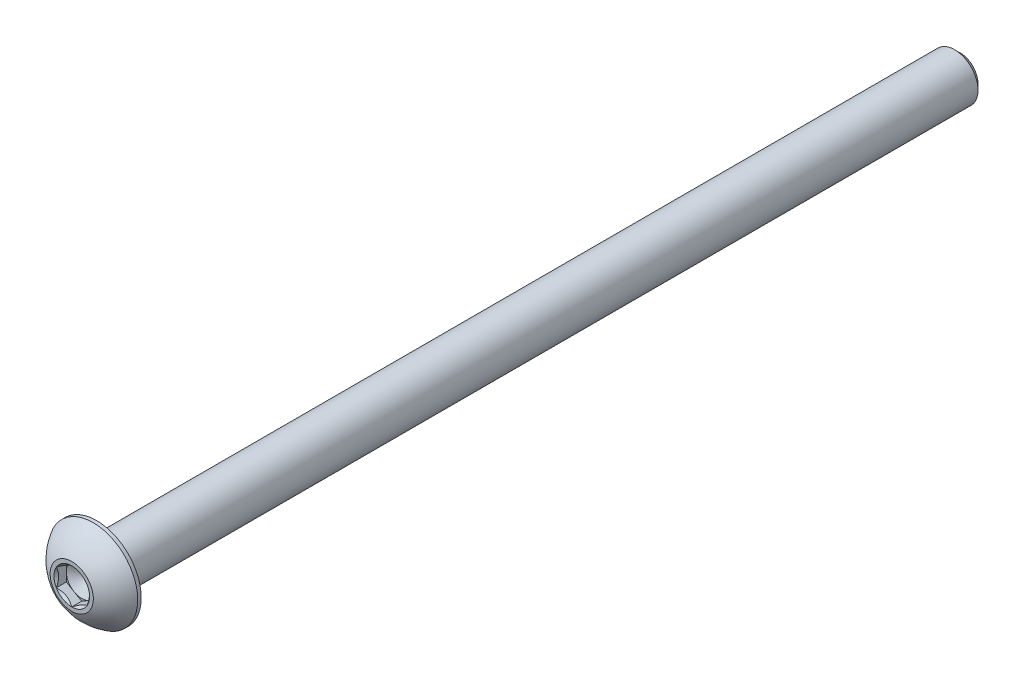
ISO-10303-21;
HEADER;
FILE_DESCRIPTION(('STEP AP214'),'2;1');
FILE_NAME('part.step','',(''),(''),'','','');
FILE_SCHEMA(('AUTOMOTIVE_DESIGN { 1 0 10303 214 1 1 1 1 }'));
ENDSEC;
DATA;
#1=APPLICATION_CONTEXT('core data for automotive mechanical design processes');
#2=APPLICATION_PROTOCOL_DEFINITION('international standard','automotive_design',2000,#1);
#3=PRODUCT_CONTEXT('',#1,'mechanical');
#4=PRODUCT('Part','Part','',(#3));
#5=PRODUCT_RELATED_PRODUCT_CATEGORY('part','',(#4));
#6=PRODUCT_DEFINITION_FORMATION('','',#4);
#7=PRODUCT_DEFINITION_CONTEXT('part definition',#1,'design');
#8=PRODUCT_DEFINITION('design','',#6,#7);
#9=PRODUCT_DEFINITION_SHAPE('','',#8);
#10=(LENGTH_UNIT() NAMED_UNIT(*) SI_UNIT(.MILLI.,.METRE.));
#11=(NAMED_UNIT(*) PLANE_ANGLE_UNIT() SI_UNIT($,.RADIAN.));
#12=(NAMED_UNIT(*) SI_UNIT($,.STERADIAN.) SOLID_ANGLE_UNIT());
#13=UNCERTAINTY_MEASURE_WITH_UNIT(LENGTH_MEASURE(1.E-05),#10,'distance_accuracy_value','');
#14=(GEOMETRIC_REPRESENTATION_CONTEXT(3) GLOBAL_UNCERTAINTY_ASSIGNED_CONTEXT((#13)) GLOBAL_UNIT_ASSIGNED_CONTEXT((#10,
#11,#12)) REPRESENTATION_CONTEXT('',''));
#15=CARTESIAN_POINT('',(0.,0.,0.));
#16=DIRECTION('',(0.,0.,1.));
#17=DIRECTION('',(1.,0.,0.));
#18=AXIS2_PLACEMENT_3D('',#15,#16,#17);
#19=CARTESIAN_POINT('',(0.,1.5875,45.7327));
#20=DIRECTION('',(0.,0.,-1.));
#21=DIRECTION('',(-1.,0.,0.));
#22=AXIS2_PLACEMENT_3D('',#19,#20,#21);
#23=PLANE('',#22);
#24=CARTESIAN_POINT('',(0.,0.,45.7327));
#25=DIRECTION('',(0.,0.,1.));
#26=DIRECTION('',(1.,0.,0.));
#27=AXIS2_PLACEMENT_3D('',#24,#25,#26);
#28=CIRCLE('',#27,2.2225);
#29=CARTESIAN_POINT('',(0.,2.22250000000001,45.7327));
#30=VERTEX_POINT('',#29);
#31=EDGE_CURVE('E191',#30,#30,#28,.T.);
#32=ORIENTED_EDGE('',*,*,#31,.T.);
#33=EDGE_LOOP('',(#32));
#34=FACE_BOUND('',#33,.T.);
#35=CARTESIAN_POINT('',(0.,0.,45.7327));
#36=DIRECTION('',(0.,0.,1.));
#37=DIRECTION('',(1.,0.,0.));
#38=AXIS2_PLACEMENT_3D('',#35,#36,#37);
#39=CIRCLE('',#38,1.83308710467706);
#40=CARTESIAN_POINT('',(0.,1.83308710467706,45.7327));
#41=VERTEX_POINT('',#40);
#42=CARTESIAN_POINT('',(-1.5875,0.91654355233853,45.7327));
#43=VERTEX_POINT('',#42);
#44=EDGE_CURVE('E133',#41,#43,#39,.T.);
#45=ORIENTED_EDGE('',*,*,#44,.F.);
#46=CARTESIAN_POINT('',(0.,0.,45.7327));
#47=DIRECTION('',(0.,0.,1.));
#48=DIRECTION('',(1.,0.,0.));
#49=AXIS2_PLACEMENT_3D('',#46,#47,#48);
#50=CIRCLE('',#49,1.83308710467706);
#51=CARTESIAN_POINT('',(1.5875,0.916543552338531,45.7327));
#52=VERTEX_POINT('',#51);
#53=EDGE_CURVE('E117',#52,#41,#50,.T.);
#54=ORIENTED_EDGE('',*,*,#53,.F.);
#55=CARTESIAN_POINT('',(0.,0.,45.7327));
#56=DIRECTION('',(0.,0.,1.));
#57=DIRECTION('',(1.,0.,0.));
#58=AXIS2_PLACEMENT_3D('',#55,#56,#57);
#59=CIRCLE('',#58,1.83308710467706);
#60=CARTESIAN_POINT('',(1.5875,-0.91654355233853,45.7327));
#61=VERTEX_POINT('',#60);
#62=EDGE_CURVE('E129',#61,#52,#59,.T.);
#63=ORIENTED_EDGE('',*,*,#62,.F.);
#64=CARTESIAN_POINT('',(0.,0.,45.7327));
#65=DIRECTION('',(0.,0.,1.));
#66=DIRECTION('',(1.,0.,0.));
#67=AXIS2_PLACEMENT_3D('',#64,#65,#66);
#68=CIRCLE('',#67,1.83308710467706);
#69=CARTESIAN_POINT('',(0.,-1.83308710467706,45.7327));
#70=VERTEX_POINT('',#69);
#71=EDGE_CURVE('E153',#70,#61,#68,.T.);
#72=ORIENTED_EDGE('',*,*,#71,.F.);
#73=CARTESIAN_POINT('',(0.,0.,45.7327));
#74=DIRECTION('',(0.,0.,1.));
#75=DIRECTION('',(1.,0.,0.));
#76=AXIS2_PLACEMENT_3D('',#73,#74,#75);
#77=CIRCLE('',#76,1.83308710467706);
#78=CARTESIAN_POINT('',(-1.5875,-0.916543552338531,45.7327));
#79=VERTEX_POINT('',#78);
#80=EDGE_CURVE('E467',#79,#70,#77,.T.);
#81=ORIENTED_EDGE('',*,*,#80,.F.);
#82=CARTESIAN_POINT('',(0.,0.,45.7327));
#83=DIRECTION('',(0.,0.,1.));
#84=DIRECTION('',(1.,0.,0.));
#85=AXIS2_PLACEMENT_3D('',#82,#83,#84);
#86=CIRCLE('',#85,1.83308710467706);
#87=EDGE_CURVE('E478',#43,#79,#86,.T.);
#88=ORIENTED_EDGE('',*,*,#87,.F.);
#89=EDGE_LOOP('',(#45,#54,#63,#72,#81,#88));
#90=FACE_BOUND('',#89,.T.);
#91=ADVANCED_FACE('F43',(#34,#90),#23,.F.);
#92=CARTESIAN_POINT('',(0.,0.,-45.7327));
#93=DIRECTION('',(0.,0.,1.));
#94=DIRECTION('',(1.,0.,0.));
#95=AXIS2_PLACEMENT_3D('',#92,#93,#94);
#96=CONICAL_SURFACE('',#95,1.81768750000001,0.785398163397441);
#97=CARTESIAN_POINT('',(0.,0.,-45.1373875));
#98=DIRECTION('',(0.,0.,1.));
#99=DIRECTION('',(1.,0.,0.));
#100=AXIS2_PLACEMENT_3D('',#97,#98,#99);
#101=CIRCLE('',#100,2.413);
#102=CARTESIAN_POINT('',(2.413,0.,-45.1373875));
#103=VERTEX_POINT('',#102);
#104=EDGE_CURVE('E11',#103,#103,#101,.T.);
#105=ORIENTED_EDGE('',*,*,#104,.F.);
#106=EDGE_LOOP('',(#105));
#107=FACE_BOUND('',#106,.T.);
#108=CARTESIAN_POINT('',(0.,0.,-45.7327));
#109=DIRECTION('',(0.,0.,1.));
#110=DIRECTION('',(1.,0.,0.));
#111=AXIS2_PLACEMENT_3D('',#108,#109,#110);
#112=CIRCLE('',#111,1.81768750000001);
#113=CARTESIAN_POINT('',(1.81768750000001,0.,-45.7327));
#114=VERTEX_POINT('',#113);
#115=EDGE_CURVE('E182',#114,#114,#112,.T.);
#116=ORIENTED_EDGE('',*,*,#115,.T.);
#117=EDGE_LOOP('',(#116));
#118=FACE_BOUND('',#117,.T.);
#119=ADVANCED_FACE('F45',(#107,#118),#96,.T.);
#120=CARTESIAN_POINT('',(0.,0.,45.7327));
#121=DIRECTION('',(0.,0.,1.));
#122=DIRECTION('',(1.,0.,0.));
#123=AXIS2_PLACEMENT_3D('',#120,#121,#122);
#124=CYLINDRICAL_SURFACE('',#123,2.413);
#125=CARTESIAN_POINT('',(0.,0.,43.1673));
#126=DIRECTION('',(0.,0.,1.));
#127=DIRECTION('',(1.,0.,0.));
#128=AXIS2_PLACEMENT_3D('',#125,#126,#127);
#129=CIRCLE('',#128,2.413);
#130=CARTESIAN_POINT('',(2.413,0.,43.1673));
#131=VERTEX_POINT('',#130);
#132=EDGE_CURVE('E52',#131,#131,#129,.T.);
#133=ORIENTED_EDGE('',*,*,#132,.F.);
#134=EDGE_LOOP('',(#133));
#135=FACE_BOUND('',#134,.T.);
#136=ORIENTED_EDGE('',*,*,#104,.T.);
#137=EDGE_LOOP('',(#136));
#138=FACE_BOUND('',#137,.T.);
#139=ADVANCED_FACE('F209',(#135,#138),#124,.T.);
#140=CARTESIAN_POINT('',(0.,4.5847,43.1673));
#141=DIRECTION('',(0.,0.,1.));
#142=DIRECTION('',(1.,0.,0.));
#143=AXIS2_PLACEMENT_3D('',#140,#141,#142);
#144=PLANE('',#143);
#145=CARTESIAN_POINT('',(0.,0.,43.1673));
#146=DIRECTION('',(0.,0.,1.));
#147=DIRECTION('',(1.,0.,0.));
#148=AXIS2_PLACEMENT_3D('',#145,#146,#147);
#149=CIRCLE('',#148,4.5847);
#150=CARTESIAN_POINT('',(4.5847,0.,43.1673));
#151=VERTEX_POINT('',#150);
#152=EDGE_CURVE('E200',#151,#151,#149,.T.);
#153=ORIENTED_EDGE('',*,*,#152,.F.);
#154=EDGE_LOOP('',(#153));
#155=FACE_BOUND('',#154,.T.);
#156=ORIENTED_EDGE('',*,*,#132,.T.);
#157=EDGE_LOOP('',(#156));
#158=FACE_BOUND('',#157,.T.);
#159=ADVANCED_FACE('F207',(#155,#158),#144,.F.);
#160=CARTESIAN_POINT('',(0.,0.,45.7327));
#161=DIRECTION('',(0.,0.,1.));
#162=DIRECTION('',(1.,0.,0.));
#163=AXIS2_PLACEMENT_3D('',#160,#161,#162);
#164=CYLINDRICAL_SURFACE('',#163,4.5847);
#165=CARTESIAN_POINT('',(0.,0.,43.5301571428571));
#166=DIRECTION('',(0.,0.,1.));
#167=DIRECTION('',(1.,0.,0.));
#168=AXIS2_PLACEMENT_3D('',#165,#166,#167);
#169=CIRCLE('',#168,4.5847);
#170=CARTESIAN_POINT('',(0.,4.5847,43.5301571428571));
#171=VERTEX_POINT('',#170);
#172=EDGE_CURVE('E196',#171,#171,#169,.T.);
#173=ORIENTED_EDGE('',*,*,#172,.F.);
#174=EDGE_LOOP('',(#173));
#175=FACE_BOUND('',#174,.T.);
#176=ORIENTED_EDGE('',*,*,#152,.T.);
#177=EDGE_LOOP('',(#176));
#178=FACE_BOUND('',#177,.T.);
#179=ADVANCED_FACE('F228',(#175,#178),#164,.T.);
#180=CARTESIAN_POINT('',(0.,0.,40.9811096257943));
#181=DIRECTION('',(0.,0.,1.));
#182=DIRECTION('',(0.,1.,0.));
#183=AXIS2_PLACEMENT_3D('',#180,#181,#182);
#184=SPHERICAL_SURFACE('',#183,5.24567606074226);
#185=CARTESIAN_POINT('',(0.,2.22250000000001,45.7327));
#186=CARTESIAN_POINT('',(0.,2.25347738137341,45.7182107482465));
#187=CARTESIAN_POINT('',(0.,2.28431303158805,45.7034184862584));
#188=CARTESIAN_POINT('',(0.,2.34568916388882,45.6732337810172));
#189=CARTESIAN_POINT('',(0.,2.37622964597494,45.6578413377641));
#190=CARTESIAN_POINT('',(0.,2.43700373620764,45.6264621091974));
#191=CARTESIAN_POINT('',(0.,2.46723734435421,45.6104753238838));
#192=CARTESIAN_POINT('',(0.,2.52738612853076,45.5779135392545));
#193=CARTESIAN_POINT('',(0.,2.55730130456074,45.5613385399389));
#194=CARTESIAN_POINT('',(0.,2.61680178002347,45.5276066638777));
#195=CARTESIAN_POINT('',(0.,2.64638707945621,45.5104497871321));
#196=CARTESIAN_POINT('',(0.,2.70521648559602,45.4755607197714));
#197=CARTESIAN_POINT('',(0.,2.73446059230308,45.4578285291564));
#198=CARTESIAN_POINT('',(0.,2.7925964267897,45.421795616496));
#199=CARTESIAN_POINT('',(0.,2.82148815456926,45.4034948944506));
#200=CARTESIAN_POINT('',(0.,2.87890817994248,45.3663319191528));
#201=CARTESIAN_POINT('',(0.,2.90743647753613,45.3474696659004));
#202=CARTESIAN_POINT('',(0.,2.96411873025196,45.3091908431166));
#203=CARTESIAN_POINT('',(0.,2.99227268537413,45.2897742735852));
#204=CARTESIAN_POINT('',(0.,3.04819548406127,45.2503942452242));
#205=CARTESIAN_POINT('',(0.,3.07596432762625,45.2304307863946));
#206=CARTESIAN_POINT('',(0.,3.13110628141819,45.1899646156009));
#207=CARTESIAN_POINT('',(0.,3.15847939164516,45.1694619036369));
#208=CARTESIAN_POINT('',(0.,3.21281940835191,45.1279250690077));
#209=CARTESIAN_POINT('',(0.,3.23978631483169,45.1068909463426));
#210=CARTESIAN_POINT('',(0.,3.29330360901048,45.0642993360128));
#211=CARTESIAN_POINT('',(0.,3.31985399670949,45.0427418483482));
#212=CARTESIAN_POINT('',(0.,3.37252809761462,44.9991117539117));
#213=CARTESIAN_POINT('',(0.,3.39865181082073,44.9770391471398));
#214=CARTESIAN_POINT('',(0.,3.45046257023396,44.9323872574181));
#215=CARTESIAN_POINT('',(0.,3.47614961644107,44.9098079744681));
#216=CARTESIAN_POINT('',(0.,3.52707721637841,44.8641513691265));
#217=CARTESIAN_POINT('',(0.,3.55231777010864,44.8410740467348));
#218=CARTESIAN_POINT('',(0.,3.60234273040088,44.7944301897495));
#219=CARTESIAN_POINT('',(0.,3.6271271369629,44.770863655156));
#220=CARTESIAN_POINT('',(0.,3.67623032270694,44.7232503881342));
#221=CARTESIAN_POINT('',(0.,3.70054910188895,44.699203655706));
#222=CARTESIAN_POINT('',(0.,3.74871173076698,44.6506391910609));
#223=CARTESIAN_POINT('',(0.,3.77255558046299,44.6261214588442));
#224=CARTESIAN_POINT('',(0.,3.8197592299269,44.576624372829));
#225=CARTESIAN_POINT('',(0.,3.8431190296948,44.5516450190307));
#226=CARTESIAN_POINT('',(0.,3.88934564401292,44.5012342446329));
#227=CARTESIAN_POINT('',(0.,3.91221245856314,44.4758028240335));
#228=CARTESIAN_POINT('',(0.,3.95744435572676,44.4244976437328));
#229=CARTESIAN_POINT('',(0.,3.97980943834017,44.3986238840316));
#230=CARTESIAN_POINT('',(0.,4.02402931682667,44.3464439224243));
#231=CARTESIAN_POINT('',(0.,4.04588411269977,44.3201377205183));
#232=CARTESIAN_POINT('',(0.,4.08907505809202,44.2671029368114));
#233=CARTESIAN_POINT('',(0.,4.11041120761118,44.2403743550105));
#234=CARTESIAN_POINT('',(0.,4.15255669906198,44.186505035384));
#235=CARTESIAN_POINT('',(0.,4.17336604099361,44.1593642975583));
#236=CARTESIAN_POINT('',(0.,4.21444995756537,44.1046810474174));
#237=CARTESIAN_POINT('',(0.,4.23472453220549,44.0771385351022));
#238=CARTESIAN_POINT('',(0.,4.27473115896065,44.0216622711516));
#239=CARTESIAN_POINT('',(0.,4.2944632110757,43.9937285195162));
#240=CARTESIAN_POINT('',(0.,4.33337724537132,43.937480461924));
#241=CARTESIAN_POINT('',(0.,4.3525592275519,43.9091661559672));
#242=CARTESIAN_POINT('',(0.,4.39036578383499,43.8521678196325));
#243=CARTESIAN_POINT('',(0.,4.40899035793751,43.8234837892547));
#244=CARTESIAN_POINT('',(0.,4.44567497738742,43.7657569778758));
#245=CARTESIAN_POINT('',(0.,4.46373502273481,43.7367141968748));
#246=CARTESIAN_POINT('',(0.,4.49928366405765,43.6782809860341));
#247=CARTESIAN_POINT('',(0.,4.5167722600331,43.6488905561945));
#248=CARTESIAN_POINT('',(0.,4.55117135982878,43.5897733169156));
#249=CARTESIAN_POINT('',(0.,4.56808186364901,43.5600465074765));
#250=CARTESIAN_POINT('',(0.,4.5847,43.5301571428571));
#251=B_SPLINE_CURVE_WITH_KNOTS('',3,(#185,#186,#187,#188,#189,#190,#191,#192,#193,#194,#195,
#196,#197,#198,#199,#200,#201,#202,#203,#204,#205,#206,#207,#208,#209,#210,#211,#212,#213,#214,
#215,#216,#217,#218,#219,#220,#221,#222,#223,#224,#225,#226,#227,#228,#229,#230,#231,#232,#233,
#234,#235,#236,#237,#238,#239,#240,#241,#242,#243,#244,#245,#246,#247,#248,#249,#250),
.UNSPECIFIED.,.F.,.F.,(4,2,2,2,2,2,2,2,2,2,2,2,2,2,2,2,2,2,2,2,2,2,2,2,2,2,2,2,2,2,2,2,4),(0.,
0.102593825831514,0.205187651663029,0.307781477494542,0.410375303326056,0.512969129157568,
0.61556295498908,0.718156780820597,0.820750606652107,0.923344432483622,1.02593825831514,
1.12853208414665,1.23112590997816,1.33371973580968,1.43631356164119,1.5389073874727,
1.64150121330422,1.74409503913573,1.84668886496725,1.94928269079876,2.05187651663027,
2.15447034246178,2.2570641682933,2.35965799412481,2.46225181995632,2.56484564578784,
2.66743947161935,2.77003329745086,2.87262712328238,2.9752209491139,3.07781477494541,
3.18040860077692,3.28300242660843),.UNSPECIFIED.);
#252=EDGE_CURVE('BSEAM220',#30,#171,#251,.T.);
#253=ORIENTED_EDGE('',*,*,#31,.F.);
#254=ORIENTED_EDGE('',*,*,#172,.T.);
#255=ORIENTED_EDGE('',*,*,#252,.T.);
#256=ORIENTED_EDGE('',*,*,#252,.F.);
#257=EDGE_LOOP('',(#253,#255,#254,#256));
#258=FACE_BOUND('',#257,.T.);
#259=ADVANCED_FACE('F220',(#258),#184,.T.);
#260=CARTESIAN_POINT('',(0.,1.81768750000001,-45.7327));
#261=DIRECTION('',(0.,0.,1.));
#262=DIRECTION('',(1.,0.,0.));
#263=AXIS2_PLACEMENT_3D('',#260,#261,#262);
#264=PLANE('',#263);
#265=ORIENTED_EDGE('',*,*,#115,.F.);
#266=EDGE_LOOP('',(#265));
#267=FACE_BOUND('',#266,.T.);
#268=ADVANCED_FACE('F218',(#267),#264,.F.);
#269=CARTESIAN_POINT('',(1.5875,0.916543552338531,45.7327));
#270=DIRECTION('',(-0.499999999999999,-0.866025403784439,0.));
#271=DIRECTION('',(0.866025403784439,-0.499999999999999,0.));
#272=AXIS2_PLACEMENT_3D('',#269,#270,#271);
#273=PLANE('',#272);
#274=CARTESIAN_POINT('',(1.5877,0.916428082284693,45.7328154809637));
#275=CARTESIAN_POINT('',(1.53312479190086,0.947937093371809,45.7013308083706));
#276=CARTESIAN_POINT('',(1.47763696320971,0.979973006203394,45.6716950460135));
#277=CARTESIAN_POINT('',(1.36449087915364,1.04529792829092,45.6174322600208));
#278=CARTESIAN_POINT('',(1.30682185887062,1.07859315267522,45.5928354351332));
#279=CARTESIAN_POINT('',(1.1905349781269,1.14573141457583,45.5507003642726));
#280=CARTESIAN_POINT('',(1.13194674474407,1.17955734689075,45.5330561927298));
#281=CARTESIAN_POINT('',(1.01348022674557,1.24795402294714,45.505871470085));
#282=CARTESIAN_POINT('',(0.953605562983896,1.28252267618758,45.4963106206951));
#283=CARTESIAN_POINT('',(0.850418771876558,1.34209759781022,45.487684413104));
#284=CARTESIAN_POINT('',(0.807240015952288,1.36702686416637,45.4864071928096));
#285=CARTESIAN_POINT('',(0.720953038535399,1.41684467380557,45.4885570558147));
#286=CARTESIAN_POINT('',(0.677844847078612,1.44173319974742,45.4919857885493));
#287=CARTESIAN_POINT('',(0.592046335002031,1.49126899379091,45.5033509944333));
#288=CARTESIAN_POINT('',(0.549356408925406,1.51591603410293,45.5112913718016));
#289=CARTESIAN_POINT('',(0.464693063478359,1.56479643938728,45.5312484144511));
#290=CARTESIAN_POINT('',(0.422719959755075,1.58902962212064,45.5432668292087));
#291=CARTESIAN_POINT('',(0.315211458113566,1.65109968448354,45.5789468972472));
#292=CARTESIAN_POINT('',(0.250342771708899,1.68855163804125,45.6052985723031));
#293=CARTESIAN_POINT('',(0.154961599380922,1.74361998356043,45.6497835368517));
#294=CARTESIAN_POINT('',(0.123530699536154,1.76176662204668,45.6654128578011));
#295=CARTESIAN_POINT('',(0.0612469855696334,1.79772614107138,45.6980984878611));
#296=CARTESIAN_POINT('',(0.0303939039605729,1.8155391760437,45.715154115657));
#297=CARTESIAN_POINT('',(-0.0002000000000033,1.8332025747309,45.7328154809637));
#298=B_SPLINE_CURVE_WITH_KNOTS('',3,(#274,#275,#276,#277,#278,#279,#280,#281,#282,#283,#284,
#285,#286,#287,#288,#289,#290,#291,#292,#293,#294,#295,#296,#297),.UNSPECIFIED.,.F.,.F.,(4,2,2,
2,2,2,2,2,2,2,2,4),(0.,0.211482650810816,0.424197870807277,0.633533884524817,0.842342653263349,
0.991755553727142,1.14122083674205,1.29081565918877,1.44047473906438,1.6781878086972,
1.79671410024894,1.91518409436632),.UNSPECIFIED.);
#299=EDGE_CURVE('E114',#52,#41,#298,.T.);
#300=ORIENTED_EDGE('',*,*,#299,.T.);
#301=DIRECTION('',(0.,0.,-1.));
#302=VECTOR('',#301,1.);
#303=CARTESIAN_POINT('',(0.,1.83308710467706,45.7327));
#304=LINE('',#303,#302);
#305=CARTESIAN_POINT('',(0.,1.83308710467706,44.70654));
#306=VERTEX_POINT('',#305);
#307=EDGE_CURVE('E179',#41,#306,#304,.T.);
#308=ORIENTED_EDGE('',*,*,#307,.T.);
#309=DIRECTION('',(-0.866025403784439,0.499999999999999,0.));
#310=VECTOR('',#309,1.);
#311=CARTESIAN_POINT('',(1.5875,0.916543552338531,44.70654));
#312=LINE('',#311,#310);
#313=CARTESIAN_POINT('',(0.793749999999999,1.3748153285078,44.70654));
#314=VERTEX_POINT('',#313);
#315=EDGE_CURVE('E509',#314,#306,#312,.T.);
#316=ORIENTED_EDGE('',*,*,#315,.F.);
#317=CARTESIAN_POINT('',(1.5875,0.916543552338531,44.70654));
#318=VERTEX_POINT('',#317);
#319=EDGE_CURVE('E59',#318,#314,#312,.T.);
#320=ORIENTED_EDGE('',*,*,#319,.F.);
#321=DIRECTION('',(0.,0.,-1.));
#322=VECTOR('',#321,1.);
#323=CARTESIAN_POINT('',(1.5875,0.916543552338531,45.7327));
#324=LINE('',#323,#322);
#325=EDGE_CURVE('E148',#52,#318,#324,.T.);
#326=ORIENTED_EDGE('',*,*,#325,.F.);
#327=EDGE_LOOP('',(#300,#308,#316,#320,#326));
#328=FACE_BOUND('',#327,.T.);
#329=ADVANCED_FACE('F155',(#328),#273,.T.);
#330=CARTESIAN_POINT('',(0.,1.83308710467706,45.7327));
#331=DIRECTION('',(0.5,-0.866025403784438,0.));
#332=DIRECTION('',(0.866025403784438,0.500000000000001,0.));
#333=AXIS2_PLACEMENT_3D('',#330,#331,#332);
#334=PLANE('',#333);
#335=CARTESIAN_POINT('',(0.000199999999998708,1.8332025747309,45.7328154809637));
#336=CARTESIAN_POINT('',(-0.0543752080991367,1.80169356364378,45.7013308083706));
#337=CARTESIAN_POINT('',(-0.10986303679029,1.7696576508122,45.6716950460135));
#338=CARTESIAN_POINT('',(-0.22300912084636,1.70433272872468,45.6174322600208));
#339=CARTESIAN_POINT('',(-0.280678141129382,1.67103750434037,45.5928354351332));
#340=CARTESIAN_POINT('',(-0.396965021873104,1.60389924243976,45.5507003642726));
#341=CARTESIAN_POINT('',(-0.455553255255931,1.57007331012484,45.5330561927298));
#342=CARTESIAN_POINT('',(-0.574019773254431,1.50167663406845,45.505871470085));
#343=CARTESIAN_POINT('',(-0.633894437016105,1.46710798082801,45.4963106206951));
#344=CARTESIAN_POINT('',(-0.737081228123442,1.40753305920537,45.487684413104));
#345=CARTESIAN_POINT('',(-0.780259984047712,1.38260379284922,45.4864071928096));
#346=CARTESIAN_POINT('',(-0.866546961464601,1.33278598321002,45.4885570558147));
#347=CARTESIAN_POINT('',(-0.909655152921388,1.30789745726817,45.4919857885493));
#348=CARTESIAN_POINT('',(-0.99545366499797,1.25836166322468,45.5033509944333));
#349=CARTESIAN_POINT('',(-1.0381435910746,1.23371462291266,45.5112913718016));
#350=CARTESIAN_POINT('',(-1.12280693652164,1.18483421762831,45.5312484144511));
#351=CARTESIAN_POINT('',(-1.16478004024493,1.16060103489495,45.5432668292087));
#352=CARTESIAN_POINT('',(-1.27228854188643,1.09853097253205,45.5789468972472));
#353=CARTESIAN_POINT('',(-1.3371572282911,1.06107901897434,45.6052985723031));
#354=CARTESIAN_POINT('',(-1.43253840061908,1.00601067345516,45.6497835368517));
#355=CARTESIAN_POINT('',(-1.46396930046384,0.987864034968913,45.6654128578011));
#356=CARTESIAN_POINT('',(-1.52625301443037,0.951904515944213,45.6980984878611));
#357=CARTESIAN_POINT('',(-1.55710609603943,0.934091480971892,45.715154115657));
#358=CARTESIAN_POINT('',(-1.5877,0.916428082284692,45.7328154809637));
#359=B_SPLINE_CURVE_WITH_KNOTS('',3,(#335,#336,#337,#338,#339,#340,#341,#342,#343,#344,#345,
#346,#347,#348,#349,#350,#351,#352,#353,#354,#355,#356,#357,#358),.UNSPECIFIED.,.F.,.F.,(4,2,2,
2,2,2,2,2,2,2,2,4),(0.,0.211482650810816,0.424197870807277,0.633533884524816,0.842342653263348,
0.991755553727141,1.14122083674204,1.29081565918877,1.44047473906438,1.6781878086972,
1.79671410024894,1.91518409436631),.UNSPECIFIED.);
#360=EDGE_CURVE('E494',#41,#43,#359,.T.);
#361=ORIENTED_EDGE('',*,*,#360,.T.);
#362=DIRECTION('',(0.,0.,-1.));
#363=VECTOR('',#362,1.);
#364=CARTESIAN_POINT('',(-1.5875,0.91654355233853,45.7327));
#365=LINE('',#364,#363);
#366=CARTESIAN_POINT('',(-1.5875,0.91654355233853,44.70654));
#367=VERTEX_POINT('',#366);
#368=EDGE_CURVE('E175',#43,#367,#365,.T.);
#369=ORIENTED_EDGE('',*,*,#368,.T.);
#370=DIRECTION('',(-0.866025403784438,-0.5,0.));
#371=VECTOR('',#370,1.);
#372=CARTESIAN_POINT('',(0.,1.83308710467706,44.70654));
#373=LINE('',#372,#371);
#374=CARTESIAN_POINT('',(-0.793750000000001,1.3748153285078,44.70654));
#375=VERTEX_POINT('',#374);
#376=EDGE_CURVE('E512',#375,#367,#373,.T.);
#377=ORIENTED_EDGE('',*,*,#376,.F.);
#378=EDGE_CURVE('E513',#306,#375,#373,.T.);
#379=ORIENTED_EDGE('',*,*,#378,.F.);
#380=ORIENTED_EDGE('',*,*,#307,.F.);
#381=EDGE_LOOP('',(#361,#369,#377,#379,#380));
#382=FACE_BOUND('',#381,.T.);
#383=ADVANCED_FACE('F226',(#382),#334,.T.);
#384=CARTESIAN_POINT('',(-1.5875,0.91654355233853,45.7327));
#385=DIRECTION('',(1.,0.,0.));
#386=DIRECTION('',(0.,1.,0.));
#387=AXIS2_PLACEMENT_3D('',#384,#385,#386);
#388=PLANE('',#387);
#389=CARTESIAN_POINT('',(-1.5875,-1.8064504268921,46.304486986584));
#390=CARTESIAN_POINT('',(-1.5875,-1.76236619947005,46.2713776518921));
#391=CARTESIAN_POINT('',(-1.5875,-1.7180340172246,46.2385993672874));
#392=CARTESIAN_POINT('',(-1.5875,-1.62877387436181,46.1738409272978));
#393=CARTESIAN_POINT('',(-1.5875,-1.58384576476286,46.1418609774832));
#394=CARTESIAN_POINT('',(-1.5875,-1.44736053267712,46.0468669615479));
#395=CARTESIAN_POINT('',(-1.5875,-1.3547728804759,45.9853088242448));
#396=CARTESIAN_POINT('',(-1.5875,-1.16075761948671,45.8646575197201));
#397=CARTESIAN_POINT('',(-1.5875,-1.05912459725148,45.805890844098));
#398=CARTESIAN_POINT('',(-1.5875,-0.850810108093358,45.6985306781202));
#399=CARTESIAN_POINT('',(-1.5875,-0.744147188151386,45.6499029254242));
#400=CARTESIAN_POINT('',(-1.5875,-0.583837187923048,45.5904180795061));
#401=CARTESIAN_POINT('',(-1.5875,-0.53251816084236,45.5733101147626));
#402=CARTESIAN_POINT('',(-1.5875,-0.428659985513867,45.5432170530757));
#403=CARTESIAN_POINT('',(-1.5875,-0.376120751676571,45.5302322462879));
#404=CARTESIAN_POINT('',(-1.5875,-0.271003698108569,45.5092703974627));
#405=CARTESIAN_POINT('',(-1.5875,-0.218442994151923,45.5012088512206));
#406=CARTESIAN_POINT('',(-1.5875,-0.112783135871373,45.4902474681039));
#407=CARTESIAN_POINT('',(-1.5875,-0.0596840710482711,45.4873467869566));
#408=CARTESIAN_POINT('',(-1.5875,0.0447055832560287,45.4869138193186));
#409=CARTESIAN_POINT('',(-1.5875,0.0959954901561846,45.4892001279368));
#410=CARTESIAN_POINT('',(-1.5875,0.198125185705279,45.4986197058015));
#411=CARTESIAN_POINT('',(-1.5875,0.248964929488491,45.5057534527826));
#412=CARTESIAN_POINT('',(-1.5875,0.350686556652123,45.5246031096994));
#413=CARTESIAN_POINT('',(-1.5875,0.401553911407878,45.536396261495));
#414=CARTESIAN_POINT('',(-1.5875,0.50217981053946,45.5639444375564));
#415=CARTESIAN_POINT('',(-1.5875,0.551938454553038,45.5796991042322));
#416=CARTESIAN_POINT('',(-1.5875,0.709597941546689,45.6355173760564));
#417=CARTESIAN_POINT('',(-1.5875,0.815228306930164,45.6819791563384));
#418=CARTESIAN_POINT('',(-1.5875,1.02151735170486,45.7852514550853));
#419=CARTESIAN_POINT('',(-1.5875,1.12215634479546,45.8420993580816));
#420=CARTESIAN_POINT('',(-1.5875,1.31447644029508,45.9593491247074));
#421=CARTESIAN_POINT('',(-1.5875,1.40635401847358,46.0194326845134));
#422=CARTESIAN_POINT('',(-1.5875,1.54171769329395,46.1123019080447));
#423=CARTESIAN_POINT('',(-1.5875,1.58625419266992,46.1435831278697));
#424=CARTESIAN_POINT('',(-1.5875,1.67471932537719,46.2069692036077));
#425=CARTESIAN_POINT('',(-1.5875,1.71864812234279,46.2390738308869));
#426=CARTESIAN_POINT('',(-1.5875,1.76232404534813,46.2715197844761));
#427=B_SPLINE_CURVE_WITH_KNOTS('',3,(#389,#390,#391,#392,#393,#394,#395,#396,#397,#398,#399,
#400,#401,#402,#403,#404,#405,#406,#407,#408,#409,#410,#411,#412,#413,#414,#415,#416,#417,#418,
#419,#420,#421,#422,#423,#424,#425,#426),.UNSPECIFIED.,.F.,.F.,(4,2,2,2,2,2,2,2,2,2,2,2,2,2,2,2,
2,2,4),(0.,0.165394720611773,0.330831599805599,0.664230904656284,1.01613642769877,
1.36683276443451,1.5289815746679,1.69114179313303,1.85043410106595,2.00970034776347,
2.16348276168557,2.31728033368487,2.47374234648083,2.63019024115108,2.97536284656899,
3.32180328575216,3.65097853196649,3.8142455159316,3.97746764647571),.UNSPECIFIED.);
#428=EDGE_CURVE('E486',#43,#79,#427,.F.);
#429=ORIENTED_EDGE('',*,*,#428,.T.);
#430=DIRECTION('',(0.,0.,-1.));
#431=VECTOR('',#430,1.);
#432=CARTESIAN_POINT('',(-1.5875,-0.916543552338531,45.7327));
#433=LINE('',#432,#431);
#434=CARTESIAN_POINT('',(-1.5875,-0.916543552338531,44.70654));
#435=VERTEX_POINT('',#434);
#436=EDGE_CURVE('E171',#79,#435,#433,.T.);
#437=ORIENTED_EDGE('',*,*,#436,.T.);
#438=DIRECTION('',(0.,-1.,0.));
#439=VECTOR('',#438,1.);
#440=CARTESIAN_POINT('',(-1.5875,0.91654355233853,44.70654));
#441=LINE('',#440,#439);
#442=CARTESIAN_POINT('',(-1.5875,0.,44.70654));
#443=VERTEX_POINT('',#442);
#444=EDGE_CURVE('E517',#443,#435,#441,.T.);
#445=ORIENTED_EDGE('',*,*,#444,.F.);
#446=EDGE_CURVE('E518',#367,#443,#441,.T.);
#447=ORIENTED_EDGE('',*,*,#446,.F.);
#448=ORIENTED_EDGE('',*,*,#368,.F.);
#449=EDGE_LOOP('',(#429,#437,#445,#447,#448));
#450=FACE_BOUND('',#449,.T.);
#451=ADVANCED_FACE('F347',(#450),#388,.T.);
#452=CARTESIAN_POINT('',(-1.5875,-0.916543552338531,45.7327));
#453=DIRECTION('',(0.5,0.866025403784439,0.));
#454=DIRECTION('',(-0.866025403784439,0.5,0.));
#455=AXIS2_PLACEMENT_3D('',#452,#453,#454);
#456=PLANE('',#455);
#457=CARTESIAN_POINT('',(-1.5877,-0.916428082284693,45.7328154809637));
#458=CARTESIAN_POINT('',(-1.53312479190087,-0.947937093371809,45.7013308083706));
#459=CARTESIAN_POINT('',(-1.47763696320971,-0.979973006203394,45.6716950460135));
#460=CARTESIAN_POINT('',(-1.36449087915364,-1.04529792829092,45.6174322600208));
#461=CARTESIAN_POINT('',(-1.30682185887062,-1.07859315267522,45.5928354351332));
#462=CARTESIAN_POINT('',(-1.1905349781269,-1.14573141457583,45.5507003642726));
#463=CARTESIAN_POINT('',(-1.13194674474407,-1.17955734689075,45.5330561927298));
#464=CARTESIAN_POINT('',(-1.01348022674557,-1.24795402294714,45.505871470085));
#465=CARTESIAN_POINT('',(-0.953605562983895,-1.28252267618759,45.4963106206951));
#466=CARTESIAN_POINT('',(-0.850418771876558,-1.34209759781022,45.487684413104));
#467=CARTESIAN_POINT('',(-0.807240015952288,-1.36702686416637,45.4864071928096));
#468=CARTESIAN_POINT('',(-0.720953038535399,-1.41684467380557,45.4885570558147));
#469=CARTESIAN_POINT('',(-0.677844847078612,-1.44173319974742,45.4919857885493));
#470=CARTESIAN_POINT('',(-0.592046335002031,-1.49126899379091,45.5033509944333));
#471=CARTESIAN_POINT('',(-0.549356408925406,-1.51591603410293,45.5112913718016));
#472=CARTESIAN_POINT('',(-0.464693063478358,-1.56479643938728,45.5312484144511));
#473=CARTESIAN_POINT('',(-0.422719959755074,-1.58902962212064,45.5432668292087));
#474=CARTESIAN_POINT('',(-0.315211458113566,-1.65109968448354,45.5789468972472));
#475=CARTESIAN_POINT('',(-0.2503427717089,-1.68855163804125,45.6052985723031));
#476=CARTESIAN_POINT('',(-0.154961599380923,-1.74361998356043,45.6497835368517));
#477=CARTESIAN_POINT('',(-0.123530699536155,-1.76176662204668,45.6654128578011));
#478=CARTESIAN_POINT('',(-0.0612469855696345,-1.79772614107138,45.6980984878611));
#479=CARTESIAN_POINT('',(-0.030393903960574,-1.8155391760437,45.715154115657));
#480=CARTESIAN_POINT('',(0.00020000000000222,-1.8332025747309,45.7328154809637));
#481=B_SPLINE_CURVE_WITH_KNOTS('',3,(#457,#458,#459,#460,#461,#462,#463,#464,#465,#466,#467,
#468,#469,#470,#471,#472,#473,#474,#475,#476,#477,#478,#479,#480),.UNSPECIFIED.,.F.,.F.,(4,2,2,
2,2,2,2,2,2,2,2,4),(0.,0.211482650810816,0.424197870807277,0.633533884524818,0.842342653263349,
0.991755553727143,1.14122083674205,1.29081565918877,1.44047473906438,1.6781878086972,
1.79671410024894,1.91518409436632),.UNSPECIFIED.);
#482=EDGE_CURVE('E470',#79,#70,#481,.T.);
#483=ORIENTED_EDGE('',*,*,#482,.T.);
#484=DIRECTION('',(0.,0.,-1.));
#485=VECTOR('',#484,1.);
#486=CARTESIAN_POINT('',(0.,-1.83308710467706,45.7327));
#487=LINE('',#486,#485);
#488=CARTESIAN_POINT('',(0.,-1.83308710467706,44.70654));
#489=VERTEX_POINT('',#488);
#490=EDGE_CURVE('E161',#70,#489,#487,.T.);
#491=ORIENTED_EDGE('',*,*,#490,.T.);
#492=DIRECTION('',(0.866025403784439,-0.5,0.));
#493=VECTOR('',#492,1.);
#494=CARTESIAN_POINT('',(-1.5875,-0.916543552338531,44.70654));
#495=LINE('',#494,#493);
#496=CARTESIAN_POINT('',(-0.79375,-1.3748153285078,44.70654));
#497=VERTEX_POINT('',#496);
#498=EDGE_CURVE('E522',#497,#489,#495,.T.);
#499=ORIENTED_EDGE('',*,*,#498,.F.);
#500=EDGE_CURVE('E523',#435,#497,#495,.T.);
#501=ORIENTED_EDGE('',*,*,#500,.F.);
#502=ORIENTED_EDGE('',*,*,#436,.F.);
#503=EDGE_LOOP('',(#483,#491,#499,#501,#502));
#504=FACE_BOUND('',#503,.T.);
#505=ADVANCED_FACE('F357',(#504),#456,.T.);
#506=CARTESIAN_POINT('',(0.,-1.83308710467706,45.7327));
#507=DIRECTION('',(-0.5,0.866025403784438,0.));
#508=DIRECTION('',(-0.866025403784438,-0.5,0.));
#509=AXIS2_PLACEMENT_3D('',#506,#507,#508);
#510=PLANE('',#509);
#511=CARTESIAN_POINT('',(-0.000199999999999383,-1.8332025747309,45.7328154809637));
#512=CARTESIAN_POINT('',(0.0543752080991362,-1.80169356364378,45.7013308083706));
#513=CARTESIAN_POINT('',(0.10986303679029,-1.7696576508122,45.6716950460135));
#514=CARTESIAN_POINT('',(0.223009120846359,-1.70433272872467,45.6174322600208));
#515=CARTESIAN_POINT('',(0.280678141129383,-1.67103750434037,45.5928354351332));
#516=CARTESIAN_POINT('',(0.396965021873105,-1.60389924243976,45.5507003642726));
#517=CARTESIAN_POINT('',(0.455553255255933,-1.57007331012484,45.5330561927298));
#518=CARTESIAN_POINT('',(0.574019773254432,-1.50167663406845,45.505871470085));
#519=CARTESIAN_POINT('',(0.633894437016105,-1.46710798082801,45.4963106206951));
#520=CARTESIAN_POINT('',(0.737081228123441,-1.40753305920537,45.487684413104));
#521=CARTESIAN_POINT('',(0.780259984047711,-1.38260379284922,45.4864071928096));
#522=CARTESIAN_POINT('',(0.8665469614646,-1.33278598321002,45.4885570558147));
#523=CARTESIAN_POINT('',(0.909655152921387,-1.30789745726817,45.4919857885493));
#524=CARTESIAN_POINT('',(0.995453664997968,-1.25836166322469,45.5033509944333));
#525=CARTESIAN_POINT('',(1.03814359107459,-1.23371462291266,45.5112913718016));
#526=CARTESIAN_POINT('',(1.12280693652164,-1.18483421762831,45.5312484144511));
#527=CARTESIAN_POINT('',(1.16478004024492,-1.16060103489495,45.5432668292087));
#528=CARTESIAN_POINT('',(1.27228854188643,-1.09853097253205,45.5789468972472));
#529=CARTESIAN_POINT('',(1.3371572282911,-1.06107901897434,45.6052985723031));
#530=CARTESIAN_POINT('',(1.43253840061908,-1.00601067345516,45.6497835368517));
#531=CARTESIAN_POINT('',(1.46396930046384,-0.987864034968913,45.6654128578011));
#532=CARTESIAN_POINT('',(1.52625301443037,-0.951904515944213,45.6980984878611));
#533=CARTESIAN_POINT('',(1.55710609603943,-0.934091480971892,45.715154115657));
#534=CARTESIAN_POINT('',(1.5877,-0.916428082284692,45.7328154809637));
#535=B_SPLINE_CURVE_WITH_KNOTS('',3,(#511,#512,#513,#514,#515,#516,#517,#518,#519,#520,#521,
#522,#523,#524,#525,#526,#527,#528,#529,#530,#531,#532,#533,#534),.UNSPECIFIED.,.F.,.F.,(4,2,2,
2,2,2,2,2,2,2,2,4),(0.,0.211482650810816,0.424197870807278,0.633533884524819,0.842342653263348,
0.99175555372714,1.14122083674204,1.29081565918877,1.44047473906438,1.6781878086972,
1.79671410024894,1.91518409436631),.UNSPECIFIED.);
#536=EDGE_CURVE('E459',#70,#61,#535,.T.);
#537=ORIENTED_EDGE('',*,*,#536,.T.);
#538=DIRECTION('',(0.,0.,-1.));
#539=VECTOR('',#538,1.);
#540=CARTESIAN_POINT('',(1.5875,-0.91654355233853,45.7327));
#541=LINE('',#540,#539);
#542=CARTESIAN_POINT('',(1.5875,-0.91654355233853,44.70654));
#543=VERTEX_POINT('',#542);
#544=EDGE_CURVE('E151',#61,#543,#541,.T.);
#545=ORIENTED_EDGE('',*,*,#544,.T.);
#546=DIRECTION('',(0.866025403784438,0.5,0.));
#547=VECTOR('',#546,1.);
#548=CARTESIAN_POINT('',(0.,-1.83308710467706,44.70654));
#549=LINE('',#548,#547);
#550=CARTESIAN_POINT('',(0.79375,-1.3748153285078,44.70654));
#551=VERTEX_POINT('',#550);
#552=EDGE_CURVE('E526',#551,#543,#549,.T.);
#553=ORIENTED_EDGE('',*,*,#552,.F.);
#554=EDGE_CURVE('E527',#489,#551,#549,.T.);
#555=ORIENTED_EDGE('',*,*,#554,.F.);
#556=ORIENTED_EDGE('',*,*,#490,.F.);
#557=EDGE_LOOP('',(#537,#545,#553,#555,#556));
#558=FACE_BOUND('',#557,.T.);
#559=ADVANCED_FACE('F367',(#558),#510,.T.);
#560=CARTESIAN_POINT('',(1.5875,-0.91654355233853,45.7327));
#561=DIRECTION('',(-1.,0.,0.));
#562=DIRECTION('',(0.,-1.,0.));
#563=AXIS2_PLACEMENT_3D('',#560,#561,#562);
#564=PLANE('',#563);
#565=CARTESIAN_POINT('',(1.5875,-1.8064504268921,46.304486986584));
#566=CARTESIAN_POINT('',(1.5875,-1.76236619947005,46.2713776518921));
#567=CARTESIAN_POINT('',(1.5875,-1.7180340172246,46.2385993672874));
#568=CARTESIAN_POINT('',(1.5875,-1.62877387436181,46.1738409272978));
#569=CARTESIAN_POINT('',(1.5875,-1.58384576476286,46.1418609774832));
#570=CARTESIAN_POINT('',(1.5875,-1.44736053267712,46.0468669615479));
#571=CARTESIAN_POINT('',(1.5875,-1.3547728804759,45.9853088242448));
#572=CARTESIAN_POINT('',(1.5875,-1.16075761948671,45.8646575197201));
#573=CARTESIAN_POINT('',(1.5875,-1.05912459725148,45.805890844098));
#574=CARTESIAN_POINT('',(1.5875,-0.850810108093357,45.6985306781202));
#575=CARTESIAN_POINT('',(1.5875,-0.744147188151386,45.6499029254242));
#576=CARTESIAN_POINT('',(1.5875,-0.583837187923047,45.5904180795061));
#577=CARTESIAN_POINT('',(1.5875,-0.532518160842359,45.5733101147626));
#578=CARTESIAN_POINT('',(1.5875,-0.428659985513866,45.5432170530757));
#579=CARTESIAN_POINT('',(1.5875,-0.37612075167657,45.5302322462879));
#580=CARTESIAN_POINT('',(1.5875,-0.271003698108569,45.5092703974627));
#581=CARTESIAN_POINT('',(1.5875,-0.218442994151922,45.5012088512206));
#582=CARTESIAN_POINT('',(1.5875,-0.112783135871372,45.4902474681039));
#583=CARTESIAN_POINT('',(1.5875,-0.0596840710482698,45.4873467869566));
#584=CARTESIAN_POINT('',(1.5875,0.04470558325603,45.4869138193186));
#585=CARTESIAN_POINT('',(1.5875,0.0959954901561858,45.4892001279368));
#586=CARTESIAN_POINT('',(1.5875,0.19812518570528,45.4986197058015));
#587=CARTESIAN_POINT('',(1.5875,0.248964929488492,45.5057534527826));
#588=CARTESIAN_POINT('',(1.5875,0.350686556652124,45.5246031096994));
#589=CARTESIAN_POINT('',(1.5875,0.401553911407879,45.536396261495));
#590=CARTESIAN_POINT('',(1.5875,0.502179810539462,45.5639444375564));
#591=CARTESIAN_POINT('',(1.5875,0.551938454553039,45.5796991042322));
#592=CARTESIAN_POINT('',(1.5875,0.709597941546691,45.6355173760564));
#593=CARTESIAN_POINT('',(1.5875,0.815228306930167,45.6819791563384));
#594=CARTESIAN_POINT('',(1.5875,1.02151735170486,45.7852514550853));
#595=CARTESIAN_POINT('',(1.5875,1.12215634479547,45.8420993580816));
#596=CARTESIAN_POINT('',(1.5875,1.31447644029508,45.9593491247074));
#597=CARTESIAN_POINT('',(1.5875,1.40635401847359,46.0194326845134));
#598=CARTESIAN_POINT('',(1.5875,1.54171769329396,46.1123019080447));
#599=CARTESIAN_POINT('',(1.5875,1.58625419266993,46.1435831278697));
#600=CARTESIAN_POINT('',(1.5875,1.67471932537719,46.2069692036077));
#601=CARTESIAN_POINT('',(1.5875,1.71864812234279,46.2390738308869));
#602=CARTESIAN_POINT('',(1.5875,1.76232404534813,46.2715197844761));
#603=B_SPLINE_CURVE_WITH_KNOTS('',3,(#565,#566,#567,#568,#569,#570,#571,#572,#573,#574,#575,
#576,#577,#578,#579,#580,#581,#582,#583,#584,#585,#586,#587,#588,#589,#590,#591,#592,#593,#594,
#595,#596,#597,#598,#599,#600,#601,#602),.UNSPECIFIED.,.F.,.F.,(4,2,2,2,2,2,2,2,2,2,2,2,2,2,2,2,
2,2,4),(0.,0.165394720611773,0.330831599805599,0.664230904656284,1.01613642769877,
1.36683276443451,1.5289815746679,1.69114179313303,1.85043410106595,2.00970034776347,
2.16348276168557,2.31728033368487,2.47374234648083,2.63019024115108,2.97536284656899,
3.32180328575217,3.6509785319665,3.81424551593161,3.97746764647571),.UNSPECIFIED.);
#604=EDGE_CURVE('E140',#61,#52,#603,.T.);
#605=ORIENTED_EDGE('',*,*,#604,.T.);
#606=ORIENTED_EDGE('',*,*,#325,.T.);
#607=DIRECTION('',(0.,1.,0.));
#608=VECTOR('',#607,1.);
#609=CARTESIAN_POINT('',(1.5875,-0.91654355233853,44.70654));
#610=LINE('',#609,#608);
#611=CARTESIAN_POINT('',(1.5875,0.,44.70654));
#612=VERTEX_POINT('',#611);
#613=EDGE_CURVE('E164',#612,#318,#610,.T.);
#614=ORIENTED_EDGE('',*,*,#613,.F.);
#615=EDGE_CURVE('E157',#543,#612,#610,.T.);
#616=ORIENTED_EDGE('',*,*,#615,.F.);
#617=ORIENTED_EDGE('',*,*,#544,.F.);
#618=EDGE_LOOP('',(#605,#606,#614,#616,#617));
#619=FACE_BOUND('',#618,.T.);
#620=ADVANCED_FACE('F146',(#619),#564,.T.);
#621=CARTESIAN_POINT('',(0.,0.,44.70654));
#622=DIRECTION('',(0.,0.,1.));
#623=DIRECTION('',(1.,0.,0.));
#624=AXIS2_PLACEMENT_3D('',#621,#622,#623);
#625=PLANE('',#624);
#626=CARTESIAN_POINT('',(0.,0.,44.70654));
#627=DIRECTION('',(0.,0.,1.));
#628=DIRECTION('',(1.,0.,0.));
#629=AXIS2_PLACEMENT_3D('',#626,#627,#628);
#630=CIRCLE('',#629,1.5875);
#631=EDGE_CURVE('E186',#551,#612,#630,.T.);
#632=ORIENTED_EDGE('',*,*,#631,.F.);
#633=ORIENTED_EDGE('',*,*,#552,.T.);
#634=ORIENTED_EDGE('',*,*,#615,.T.);
#635=EDGE_LOOP('',(#632,#633,#634));
#636=FACE_BOUND('',#635,.T.);
#637=ADVANCED_FACE('F269',(#636),#625,.T.);
#638=EDGE_CURVE('E542',#497,#551,#630,.T.);
#639=ORIENTED_EDGE('',*,*,#638,.F.);
#640=ORIENTED_EDGE('',*,*,#498,.T.);
#641=ORIENTED_EDGE('',*,*,#554,.T.);
#642=EDGE_LOOP('',(#639,#640,#641));
#643=FACE_BOUND('',#642,.T.);
#644=ADVANCED_FACE('F274',(#643),#625,.T.);
#645=EDGE_CURVE('E545',#443,#497,#630,.T.);
#646=ORIENTED_EDGE('',*,*,#645,.F.);
#647=ORIENTED_EDGE('',*,*,#444,.T.);
#648=ORIENTED_EDGE('',*,*,#500,.T.);
#649=EDGE_LOOP('',(#646,#647,#648));
#650=FACE_BOUND('',#649,.T.);
#651=ADVANCED_FACE('F287',(#650),#625,.T.);
#652=EDGE_CURVE('E547',#375,#443,#630,.T.);
#653=ORIENTED_EDGE('',*,*,#652,.F.);
#654=ORIENTED_EDGE('',*,*,#376,.T.);
#655=ORIENTED_EDGE('',*,*,#446,.T.);
#656=EDGE_LOOP('',(#653,#654,#655));
#657=FACE_BOUND('',#656,.T.);
#658=ADVANCED_FACE('F296',(#657),#625,.T.);
#659=EDGE_CURVE('E192',#314,#375,#630,.T.);
#660=ORIENTED_EDGE('',*,*,#659,.F.);
#661=ORIENTED_EDGE('',*,*,#315,.T.);
#662=ORIENTED_EDGE('',*,*,#378,.T.);
#663=EDGE_LOOP('',(#660,#661,#662));
#664=FACE_BOUND('',#663,.T.);
#665=ADVANCED_FACE('F305',(#664),#625,.T.);
#666=EDGE_CURVE('E187',#612,#314,#630,.T.);
#667=ORIENTED_EDGE('',*,*,#666,.F.);
#668=ORIENTED_EDGE('',*,*,#613,.T.);
#669=ORIENTED_EDGE('',*,*,#319,.T.);
#670=EDGE_LOOP('',(#667,#668,#669));
#671=FACE_BOUND('',#670,.T.);
#672=ADVANCED_FACE('F277',(#671),#625,.T.);
#673=CARTESIAN_POINT('',(0.,0.,44.70654));
#674=DIRECTION('',(0.,0.,1.));
#675=DIRECTION('',(1.,0.,0.));
#676=AXIS2_PLACEMENT_3D('',#673,#674,#675);
#677=CONICAL_SURFACE('',#676,1.5875,1.0471975511966);
#678=CARTESIAN_POINT('',(0.,0.,43.7899964476615));
#679=VERTEX_POINT('',#678);
#680=VERTEX_LOOP('',#679);
#681=FACE_BOUND('',#680,.T.);
#682=ORIENTED_EDGE('',*,*,#666,.T.);
#683=ORIENTED_EDGE('',*,*,#659,.T.);
#684=ORIENTED_EDGE('',*,*,#652,.T.);
#685=ORIENTED_EDGE('',*,*,#645,.T.);
#686=ORIENTED_EDGE('',*,*,#638,.T.);
#687=ORIENTED_EDGE('',*,*,#631,.T.);
#688=EDGE_LOOP('',(#682,#683,#684,#685,#686,#687));
#689=FACE_BOUND('',#688,.T.);
#690=ADVANCED_FACE('F237',(#681,#689),#677,.F.);
#691=CARTESIAN_POINT('',(0.,0.,45.7327));
#692=DIRECTION('',(0.,0.,1.));
#693=DIRECTION('',(1.,0.,0.));
#694=AXIS2_PLACEMENT_3D('',#691,#692,#693);
#695=CONICAL_SURFACE('',#694,1.83308710467706,0.78539816339745);
#696=ORIENTED_EDGE('',*,*,#44,.T.);
#697=ORIENTED_EDGE('',*,*,#360,.F.);
#698=EDGE_LOOP('',(#696,#697));
#699=FACE_BOUND('',#698,.T.);
#700=ADVANCED_FACE('F328',(#699),#695,.F.);
#701=CARTESIAN_POINT('',(0.,0.,45.7327));
#702=DIRECTION('',(0.,0.,1.));
#703=DIRECTION('',(1.,0.,0.));
#704=AXIS2_PLACEMENT_3D('',#701,#702,#703);
#705=CONICAL_SURFACE('',#704,1.83308710467706,0.78539816339745);
#706=ORIENTED_EDGE('',*,*,#87,.T.);
#707=ORIENTED_EDGE('',*,*,#428,.F.);
#708=EDGE_LOOP('',(#706,#707));
#709=FACE_BOUND('',#708,.T.);
#710=ADVANCED_FACE('F390',(#709),#705,.F.);
#711=CARTESIAN_POINT('',(0.,0.,45.7327));
#712=DIRECTION('',(0.,0.,1.));
#713=DIRECTION('',(1.,0.,0.));
#714=AXIS2_PLACEMENT_3D('',#711,#712,#713);
#715=CONICAL_SURFACE('',#714,1.83308710467706,0.78539816339745);
#716=ORIENTED_EDGE('',*,*,#80,.T.);
#717=ORIENTED_EDGE('',*,*,#482,.F.);
#718=EDGE_LOOP('',(#716,#717));
#719=FACE_BOUND('',#718,.T.);
#720=ADVANCED_FACE('F400',(#719),#715,.F.);
#721=CARTESIAN_POINT('',(0.,0.,45.7327));
#722=DIRECTION('',(0.,0.,1.));
#723=DIRECTION('',(1.,0.,0.));
#724=AXIS2_PLACEMENT_3D('',#721,#722,#723);
#725=CONICAL_SURFACE('',#724,1.83308710467706,0.78539816339745);
#726=ORIENTED_EDGE('',*,*,#71,.T.);
#727=ORIENTED_EDGE('',*,*,#536,.F.);
#728=EDGE_LOOP('',(#726,#727));
#729=FACE_BOUND('',#728,.T.);
#730=ADVANCED_FACE('F410',(#729),#725,.F.);
#731=CARTESIAN_POINT('',(0.,0.,45.7327));
#732=DIRECTION('',(0.,0.,1.));
#733=DIRECTION('',(1.,0.,0.));
#734=AXIS2_PLACEMENT_3D('',#731,#732,#733);
#735=CONICAL_SURFACE('',#734,1.83308710467706,0.78539816339745);
#736=ORIENTED_EDGE('',*,*,#62,.T.);
#737=ORIENTED_EDGE('',*,*,#604,.F.);
#738=EDGE_LOOP('',(#736,#737));
#739=FACE_BOUND('',#738,.T.);
#740=ADVANCED_FACE('F139',(#739),#735,.F.);
#741=CARTESIAN_POINT('',(0.,0.,45.7327));
#742=DIRECTION('',(0.,0.,1.));
#743=DIRECTION('',(1.,0.,0.));
#744=AXIS2_PLACEMENT_3D('',#741,#742,#743);
#745=CONICAL_SURFACE('',#744,1.83308710467706,0.78539816339745);
#746=ORIENTED_EDGE('',*,*,#53,.T.);
#747=ORIENTED_EDGE('',*,*,#299,.F.);
#748=EDGE_LOOP('',(#746,#747));
#749=FACE_BOUND('',#748,.T.);
#750=ADVANCED_FACE('F116',(#749),#745,.F.);
#751=CLOSED_SHELL('',(#91,#119,#139,#159,#179,#259,#268,#329,#383,#451,#505,#559,#620,#637,#644,
#651,#658,#665,#672,#690,#700,#710,#720,#730,#740,#750));
#752=MANIFOLD_SOLID_BREP('B2',#751);
#753=ADVANCED_BREP_SHAPE_REPRESENTATION('',(#18,#752),#14);
#754=SHAPE_DEFINITION_REPRESENTATION(#9,#753);
ENDSEC;
END-ISO-10303-21;
